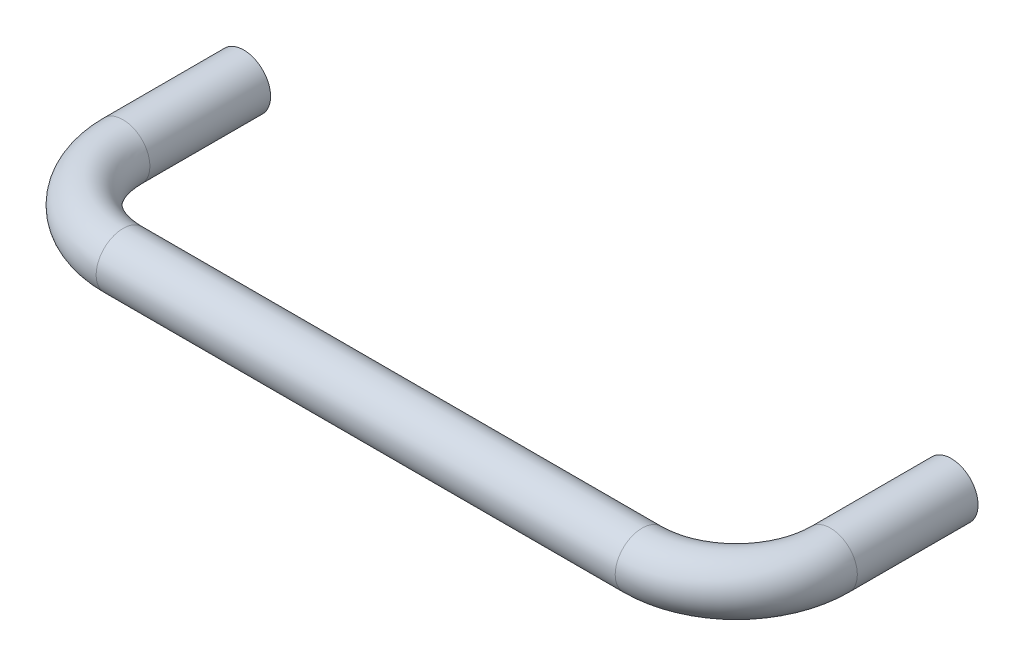
ISO-10303-21;
HEADER;
FILE_DESCRIPTION(('STEP AP214'),'2;1');
FILE_NAME('part.step','',(''),(''),'','','');
FILE_SCHEMA(('AUTOMOTIVE_DESIGN { 1 0 10303 214 1 1 1 1 }'));
ENDSEC;
DATA;
#1=APPLICATION_CONTEXT('core data for automotive mechanical design processes');
#2=APPLICATION_PROTOCOL_DEFINITION('international standard','automotive_design',2000,#1);
#3=PRODUCT_CONTEXT('',#1,'mechanical');
#4=PRODUCT('Part','Part','',(#3));
#5=PRODUCT_RELATED_PRODUCT_CATEGORY('part','',(#4));
#6=PRODUCT_DEFINITION_FORMATION('','',#4);
#7=PRODUCT_DEFINITION_CONTEXT('part definition',#1,'design');
#8=PRODUCT_DEFINITION('design','',#6,#7);
#9=PRODUCT_DEFINITION_SHAPE('','',#8);
#10=(LENGTH_UNIT() NAMED_UNIT(*) SI_UNIT(.MILLI.,.METRE.));
#11=(NAMED_UNIT(*) PLANE_ANGLE_UNIT() SI_UNIT($,.RADIAN.));
#12=(NAMED_UNIT(*) SI_UNIT($,.STERADIAN.) SOLID_ANGLE_UNIT());
#13=UNCERTAINTY_MEASURE_WITH_UNIT(LENGTH_MEASURE(1.E-05),#10,'distance_accuracy_value','');
#14=(GEOMETRIC_REPRESENTATION_CONTEXT(3) GLOBAL_UNCERTAINTY_ASSIGNED_CONTEXT((#13)) GLOBAL_UNIT_ASSIGNED_CONTEXT((#10,
#11,#12)) REPRESENTATION_CONTEXT('',''));
#15=CARTESIAN_POINT('',(0.,0.,0.));
#16=DIRECTION('',(0.,0.,1.));
#17=DIRECTION('',(1.,0.,0.));
#18=AXIS2_PLACEMENT_3D('',#15,#16,#17);
#19=CARTESIAN_POINT('',(-62.7062500000011,-1.59594559789866E-13,-19.0500000000001));
#20=DIRECTION('',(0.,0.,1.));
#21=DIRECTION('',(1.00000000000001,0.,0.));
#22=AXIS2_PLACEMENT_3D('',#19,#20,#21);
#23=PLANE('',#22);
#24=CARTESIAN_POINT('',(-62.7062500000011,-1.59594559789866E-13,-19.0500000000001));
#25=DIRECTION('',(0.,0.,-1.));
#26=DIRECTION('',(-1.00000000000001,0.,0.));
#27=AXIS2_PLACEMENT_3D('',#24,#25,#26);
#28=CIRCLE('',#27,1.52400000000001);
#29=CARTESIAN_POINT('',(-64.2302500000011,-1.6069434671806E-13,-19.0500000000001));
#30=VERTEX_POINT('',#29);
#31=EDGE_CURVE('E87',#30,#30,#28,.T.);
#32=ORIENTED_EDGE('',*,*,#31,.F.);
#33=EDGE_LOOP('',(#32));
#34=FACE_BOUND('',#33,.T.);
#35=CARTESIAN_POINT('',(-62.7062500000011,-1.59594559789866E-13,-19.0500000000001));
#36=DIRECTION('',(0.,0.,1.));
#37=DIRECTION('',(1.00000000000001,0.,0.));
#38=AXIS2_PLACEMENT_3D('',#35,#36,#37);
#39=CIRCLE('',#38,4.7625);
#40=CARTESIAN_POINT('',(-57.943750000001,0.,-19.0500000000001));
#41=VERTEX_POINT('',#40);
#42=EDGE_CURVE('E58',#41,#41,#39,.T.);
#43=ORIENTED_EDGE('',*,*,#42,.F.);
#44=EDGE_LOOP('',(#43));
#45=FACE_BOUND('',#44,.T.);
#46=ADVANCED_FACE('F45',(#34,#45),#23,.F.);
#47=CARTESIAN_POINT('',(62.706250000001,0.,-19.05));
#48=DIRECTION('',(0.,0.,-1.));
#49=DIRECTION('',(-1.00000000000001,0.,0.));
#50=AXIS2_PLACEMENT_3D('',#47,#48,#49);
#51=PLANE('',#50);
#52=CARTESIAN_POINT('',(62.706250000001,0.,-19.05));
#53=DIRECTION('',(0.,0.,-1.));
#54=DIRECTION('',(-1.00000000000001,0.,0.));
#55=AXIS2_PLACEMENT_3D('',#52,#53,#54);
#56=CIRCLE('',#55,1.52400000000001);
#57=CARTESIAN_POINT('',(61.182250000001,0.,-19.05));
#58=VERTEX_POINT('',#57);
#59=EDGE_CURVE('E79',#58,#58,#56,.T.);
#60=ORIENTED_EDGE('',*,*,#59,.F.);
#61=EDGE_LOOP('',(#60));
#62=FACE_BOUND('',#61,.T.);
#63=CARTESIAN_POINT('',(62.706250000001,0.,-19.05));
#64=DIRECTION('',(0.,0.,-1.));
#65=DIRECTION('',(-1.00000000000001,0.,0.));
#66=AXIS2_PLACEMENT_3D('',#63,#64,#65);
#67=CIRCLE('',#66,4.7625);
#68=CARTESIAN_POINT('',(57.9437500000009,0.,-19.0500000000001));
#69=VERTEX_POINT('',#68);
#70=EDGE_CURVE('E11',#69,#69,#67,.T.);
#71=ORIENTED_EDGE('',*,*,#70,.T.);
#72=EDGE_LOOP('',(#71));
#73=FACE_BOUND('',#72,.T.);
#74=ADVANCED_FACE('F131',(#62,#73),#51,.T.);
#75=CARTESIAN_POINT('',(-62.7062500000011,-1.59594559789866E-13,-19.0500000000001));
#76=DIRECTION('',(0.,0.,1.));
#77=DIRECTION('',(1.00000000000001,0.,0.));
#78=AXIS2_PLACEMENT_3D('',#75,#76,#77);
#79=CYLINDRICAL_SURFACE('',#78,4.7625);
#80=CARTESIAN_POINT('',(-62.7062500000011,-1.38777878078145E-13,2.34949999999989));
#81=DIRECTION('',(0.,0.,1.));
#82=DIRECTION('',(1.00000000000001,0.,0.));
#83=AXIS2_PLACEMENT_3D('',#80,#81,#82);
#84=CIRCLE('',#83,4.7625);
#85=CARTESIAN_POINT('',(-67.4687500000006,-1.64501914413919E-13,2.34949999999989));
#86=VERTEX_POINT('',#85);
#87=EDGE_CURVE('E92',#86,#86,#84,.T.);
#88=ORIENTED_EDGE('',*,*,#87,.F.);
#89=EDGE_LOOP('',(#88));
#90=FACE_BOUND('',#89,.T.);
#91=ORIENTED_EDGE('',*,*,#42,.T.);
#92=EDGE_LOOP('',(#91));
#93=FACE_BOUND('',#92,.T.);
#94=ADVANCED_FACE('F125',(#90,#93),#79,.T.);
#95=CARTESIAN_POINT('',(-46.0057500000007,0.,2.34949999999989));
#96=DIRECTION('',(0.,1.00000000000001,0.));
#97=DIRECTION('',(0.,0.,1.));
#98=AXIS2_PLACEMENT_3D('',#95,#96,#97);
#99=TOROIDAL_SURFACE('',#98,16.7005,4.7625);
#100=CARTESIAN_POINT('',(-46.0057500000006,-1.04083408558608E-13,19.0499999999999));
#101=DIRECTION('',(1.00000000000001,0.,0.));
#102=DIRECTION('',(0.,0.,-1.));
#103=AXIS2_PLACEMENT_3D('',#100,#101,#102);
#104=CIRCLE('',#103,4.7625);
#105=CARTESIAN_POINT('',(-46.0057500000006,-1.19913584765241E-13,23.8124999999999));
#106=VERTEX_POINT('',#105);
#107=EDGE_CURVE('E96',#106,#106,#104,.T.);
#108=CARTESIAN_POINT('',(-46.0057500000007,0.,2.34949999999989));
#109=DIRECTION('',(0.,1.00000000000001,0.));
#110=DIRECTION('',(0.,0.,1.));
#111=AXIS2_PLACEMENT_3D('',#108,#109,#110);
#112=CIRCLE('',#111,21.463);
#113=EDGE_CURVE('',#86,#106,#112,.T.);
#114=ORIENTED_EDGE('',*,*,#87,.T.);
#115=ORIENTED_EDGE('',*,*,#107,.F.);
#116=ORIENTED_EDGE('',*,*,#113,.T.);
#117=ORIENTED_EDGE('',*,*,#113,.F.);
#118=EDGE_LOOP('',(#114,#116,#115,#117));
#119=FACE_BOUND('',#118,.T.);
#120=ADVANCED_FACE('F119',(#119),#99,.T.);
#121=CARTESIAN_POINT('',(-46.0057500000006,-1.04083408558608E-13,19.0499999999999));
#122=DIRECTION('',(1.00000000000001,0.,0.));
#123=DIRECTION('',(0.,0.,-1.));
#124=AXIS2_PLACEMENT_3D('',#121,#122,#123);
#125=CYLINDRICAL_SURFACE('',#124,4.7625);
#126=CARTESIAN_POINT('',(46.0057500000009,1.04083408558608E-13,19.0499999999999));
#127=DIRECTION('',(1.00000000000001,0.,0.));
#128=DIRECTION('',(0.,0.,-1.));
#129=AXIS2_PLACEMENT_3D('',#126,#127,#128);
#130=CIRCLE('',#129,4.7625);
#131=CARTESIAN_POINT('',(46.0057500000009,1.17934812739412E-13,23.8124999999999));
#132=VERTEX_POINT('',#131);
#133=EDGE_CURVE('E100',#132,#132,#130,.T.);
#134=ORIENTED_EDGE('',*,*,#133,.F.);
#135=EDGE_LOOP('',(#134));
#136=FACE_BOUND('',#135,.T.);
#137=ORIENTED_EDGE('',*,*,#107,.T.);
#138=EDGE_LOOP('',(#137));
#139=FACE_BOUND('',#138,.T.);
#140=ADVANCED_FACE('F113',(#136,#139),#125,.T.);
#141=CARTESIAN_POINT('',(46.0057500000008,0.,2.34949999999989));
#142=DIRECTION('',(0.,1.00000000000001,0.));
#143=DIRECTION('',(0.,0.,1.));
#144=AXIS2_PLACEMENT_3D('',#141,#142,#143);
#145=TOROIDAL_SURFACE('',#144,16.7005,4.7625);
#146=CARTESIAN_POINT('',(62.7062500000009,0.,2.34949999999989));
#147=DIRECTION('',(0.,0.,-1.));
#148=DIRECTION('',(-1.00000000000001,0.,0.));
#149=AXIS2_PLACEMENT_3D('',#146,#147,#148);
#150=CIRCLE('',#149,4.7625);
#151=CARTESIAN_POINT('',(67.4687500000008,0.,2.34949999999989));
#152=VERTEX_POINT('',#151);
#153=EDGE_CURVE('E53',#152,#152,#150,.T.);
#154=CARTESIAN_POINT('',(46.0057500000008,0.,2.34949999999989));
#155=DIRECTION('',(0.,1.00000000000001,0.));
#156=DIRECTION('',(0.,0.,1.));
#157=AXIS2_PLACEMENT_3D('',#154,#155,#156);
#158=CIRCLE('',#157,21.463);
#159=EDGE_CURVE('',#132,#152,#158,.T.);
#160=ORIENTED_EDGE('',*,*,#133,.T.);
#161=ORIENTED_EDGE('',*,*,#153,.F.);
#162=ORIENTED_EDGE('',*,*,#159,.T.);
#163=ORIENTED_EDGE('',*,*,#159,.F.);
#164=EDGE_LOOP('',(#160,#162,#161,#163));
#165=FACE_BOUND('',#164,.T.);
#166=ADVANCED_FACE('F110',(#165),#145,.T.);
#167=CARTESIAN_POINT('',(62.7062500000009,0.,2.34949999999989));
#168=DIRECTION('',(0.,0.,-1.));
#169=DIRECTION('',(-1.00000000000001,0.,0.));
#170=AXIS2_PLACEMENT_3D('',#167,#168,#169);
#171=CYLINDRICAL_SURFACE('',#170,4.7625);
#172=ORIENTED_EDGE('',*,*,#70,.F.);
#173=EDGE_LOOP('',(#172));
#174=FACE_BOUND('',#173,.T.);
#175=ORIENTED_EDGE('',*,*,#153,.T.);
#176=EDGE_LOOP('',(#175));
#177=FACE_BOUND('',#176,.T.);
#178=ADVANCED_FACE('F108',(#174,#177),#171,.T.);
#179=CARTESIAN_POINT('',(62.706250000001,0.,-19.05));
#180=DIRECTION('',(0.,0.,1.));
#181=DIRECTION('',(1.00000000000001,0.,0.));
#182=AXIS2_PLACEMENT_3D('',#179,#180,#181);
#183=CYLINDRICAL_SURFACE('',#182,1.52400000000001);
#184=ORIENTED_EDGE('',*,*,#59,.T.);
#185=EDGE_LOOP('',(#184));
#186=FACE_BOUND('',#185,.T.);
#187=CARTESIAN_POINT('',(62.706250000001,1.2490009027033E-13,-13.9700000000001));
#188=DIRECTION('',(0.,0.,-1.));
#189=DIRECTION('',(-1.00000000000001,0.,0.));
#190=AXIS2_PLACEMENT_3D('',#187,#188,#189);
#191=CIRCLE('',#190,1.52400000000001);
#192=CARTESIAN_POINT('',(61.182250000001,1.23800303342136E-13,-13.9700000000001));
#193=VERTEX_POINT('',#192);
#194=EDGE_CURVE('E76',#193,#193,#191,.T.);
#195=ORIENTED_EDGE('',*,*,#194,.F.);
#196=EDGE_LOOP('',(#195));
#197=FACE_BOUND('',#196,.T.);
#198=ADVANCED_FACE('F72',(#186,#197),#183,.F.);
#199=CARTESIAN_POINT('',(62.706250000001,1.2490009027033E-13,-13.9700000000001));
#200=DIRECTION('',(0.,0.,-1.));
#201=DIRECTION('',(-1.00000000000001,0.,0.));
#202=AXIS2_PLACEMENT_3D('',#199,#200,#201);
#203=CONICAL_SURFACE('',#202,1.52400000000001,1.0471975511966);
#204=CARTESIAN_POINT('',(62.706250000001,1.2490009027033E-13,-13.0901181897551));
#205=VERTEX_POINT('',#204);
#206=VERTEX_LOOP('',#205);
#207=FACE_BOUND('',#206,.T.);
#208=ORIENTED_EDGE('',*,*,#194,.T.);
#209=EDGE_LOOP('',(#208));
#210=FACE_BOUND('',#209,.T.);
#211=ADVANCED_FACE('F68',(#207,#210),#203,.F.);
#212=CARTESIAN_POINT('',(-62.7062500000011,-1.59594559789866E-13,-19.0500000000001));
#213=DIRECTION('',(0.,0.,1.));
#214=DIRECTION('',(1.00000000000001,0.,0.));
#215=AXIS2_PLACEMENT_3D('',#212,#213,#214);
#216=CYLINDRICAL_SURFACE('',#215,1.52400000000001);
#217=ORIENTED_EDGE('',*,*,#31,.T.);
#218=EDGE_LOOP('',(#217));
#219=FACE_BOUND('',#218,.T.);
#220=CARTESIAN_POINT('',(-62.7062500000009,0.,-13.9700000000001));
#221=DIRECTION('',(0.,0.,-1.));
#222=DIRECTION('',(-1.00000000000001,0.,0.));
#223=AXIS2_PLACEMENT_3D('',#220,#221,#222);
#224=CIRCLE('',#223,1.52400000000001);
#225=CARTESIAN_POINT('',(-64.230250000001,0.,-13.9700000000001));
#226=VERTEX_POINT('',#225);
#227=EDGE_CURVE('E84',#226,#226,#224,.T.);
#228=ORIENTED_EDGE('',*,*,#227,.F.);
#229=EDGE_LOOP('',(#228));
#230=FACE_BOUND('',#229,.T.);
#231=ADVANCED_FACE('F71',(#219,#230),#216,.F.);
#232=CARTESIAN_POINT('',(-62.7062500000009,0.,-13.9700000000001));
#233=DIRECTION('',(0.,0.,-1.));
#234=DIRECTION('',(-1.00000000000001,0.,0.));
#235=AXIS2_PLACEMENT_3D('',#232,#233,#234);
#236=CONICAL_SURFACE('',#235,1.52400000000001,1.0471975511966);
#237=CARTESIAN_POINT('',(-62.7062500000009,0.,-13.0901181897551));
#238=VERTEX_POINT('',#237);
#239=VERTEX_LOOP('',#238);
#240=FACE_BOUND('',#239,.T.);
#241=ORIENTED_EDGE('',*,*,#227,.T.);
#242=EDGE_LOOP('',(#241));
#243=FACE_BOUND('',#242,.T.);
#244=ADVANCED_FACE('F161',(#240,#243),#236,.F.);
#245=CLOSED_SHELL('',(#46,#74,#94,#120,#140,#166,#178,#198,#211,#231,#244));
#246=MANIFOLD_SOLID_BREP('B2',#245);
#247=ADVANCED_BREP_SHAPE_REPRESENTATION('',(#18,#246),#14);
#248=SHAPE_DEFINITION_REPRESENTATION(#9,#247);
ENDSEC;
END-ISO-10303-21;
